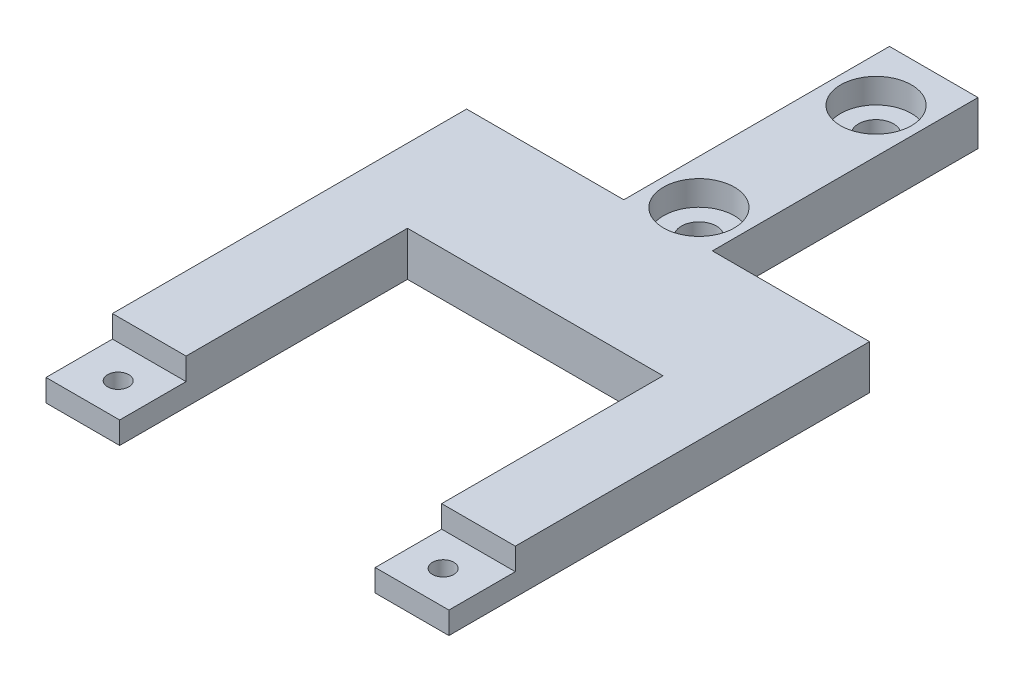
ISO-10303-21;
HEADER;
FILE_DESCRIPTION(('STEP AP214'),'2;1');
FILE_NAME('part.step','',(''),(''),'','','');
FILE_SCHEMA(('AUTOMOTIVE_DESIGN { 1 0 10303 214 1 1 1 1 }'));
ENDSEC;
DATA;
#1=APPLICATION_CONTEXT('core data for automotive mechanical design processes');
#2=APPLICATION_PROTOCOL_DEFINITION('international standard','automotive_design',2000,#1);
#3=PRODUCT_CONTEXT('',#1,'mechanical');
#4=PRODUCT('Part','Part','',(#3));
#5=PRODUCT_RELATED_PRODUCT_CATEGORY('part','',(#4));
#6=PRODUCT_DEFINITION_FORMATION('','',#4);
#7=PRODUCT_DEFINITION_CONTEXT('part definition',#1,'design');
#8=PRODUCT_DEFINITION('design','',#6,#7);
#9=PRODUCT_DEFINITION_SHAPE('','',#8);
#10=(LENGTH_UNIT() NAMED_UNIT(*) SI_UNIT(.MILLI.,.METRE.));
#11=(NAMED_UNIT(*) PLANE_ANGLE_UNIT() SI_UNIT($,.RADIAN.));
#12=(NAMED_UNIT(*) SI_UNIT($,.STERADIAN.) SOLID_ANGLE_UNIT());
#13=UNCERTAINTY_MEASURE_WITH_UNIT(LENGTH_MEASURE(1.E-05),#10,'distance_accuracy_value','');
#14=(GEOMETRIC_REPRESENTATION_CONTEXT(3) GLOBAL_UNCERTAINTY_ASSIGNED_CONTEXT((#13)) GLOBAL_UNIT_ASSIGNED_CONTEXT((#10,
#11,#12)) REPRESENTATION_CONTEXT('',''));
#15=CARTESIAN_POINT('',(0.,0.,0.));
#16=DIRECTION('',(0.,0.,1.));
#17=DIRECTION('',(1.,0.,0.));
#18=AXIS2_PLACEMENT_3D('',#15,#16,#17);
#19=CARTESIAN_POINT('',(-1.04723595372771E-13,-5.14368142394339,-29.9940298141337));
#20=DIRECTION('',(0.,1.,0.));
#21=DIRECTION('',(0.,0.,1.));
#22=AXIS2_PLACEMENT_3D('',#19,#20,#21);
#23=CYLINDRICAL_SURFACE('',#22,1.2573);
#24=CARTESIAN_POINT('',(-1.04723595372771E-13,-1.5875,-29.9940298141337));
#25=DIRECTION('',(0.,1.,0.));
#26=DIRECTION('',(0.,0.,1.));
#27=AXIS2_PLACEMENT_3D('',#24,#25,#26);
#28=CIRCLE('',#27,1.2573);
#29=CARTESIAN_POINT('',(-1.04723595372771E-13,-1.5875,-28.7367298141337));
#30=VERTEX_POINT('',#29);
#31=EDGE_CURVE('E240',#30,#30,#28,.F.);
#32=ORIENTED_EDGE('',*,*,#31,.T.);
#33=EDGE_LOOP('',(#32));
#34=FACE_BOUND('',#33,.T.);
#35=CARTESIAN_POINT('',(-1.04723595372771E-13,-0.1905,-29.9940298141337));
#36=DIRECTION('',(0.,1.,0.));
#37=DIRECTION('',(0.,0.,1.));
#38=AXIS2_PLACEMENT_3D('',#35,#36,#37);
#39=CIRCLE('',#38,1.2573);
#40=CARTESIAN_POINT('',(-1.04723595372771E-13,-0.1905,-28.7367298141337));
#41=VERTEX_POINT('',#40);
#42=EDGE_CURVE('E53',#41,#41,#39,.F.);
#43=ORIENTED_EDGE('',*,*,#42,.F.);
#44=EDGE_LOOP('',(#43));
#45=FACE_BOUND('',#44,.T.);
#46=ADVANCED_FACE('F49',(#34,#45),#23,.F.);
#47=CARTESIAN_POINT('',(0.,-5.14368142394339,-17.2940298141337));
#48=DIRECTION('',(0.,1.,0.));
#49=DIRECTION('',(0.,0.,1.));
#50=AXIS2_PLACEMENT_3D('',#47,#48,#49);
#51=CYLINDRICAL_SURFACE('',#50,1.2573);
#52=CARTESIAN_POINT('',(0.,-1.5875,-17.2940298141337));
#53=DIRECTION('',(0.,1.,0.));
#54=DIRECTION('',(0.,0.,1.));
#55=AXIS2_PLACEMENT_3D('',#52,#53,#54);
#56=CIRCLE('',#55,1.2573);
#57=CARTESIAN_POINT('',(0.,-1.5875,-16.0367298141337));
#58=VERTEX_POINT('',#57);
#59=EDGE_CURVE('E260',#58,#58,#56,.F.);
#60=ORIENTED_EDGE('',*,*,#59,.T.);
#61=EDGE_LOOP('',(#60));
#62=FACE_BOUND('',#61,.T.);
#63=CARTESIAN_POINT('',(0.,-0.1905,-17.2940298141337));
#64=DIRECTION('',(0.,1.,0.));
#65=DIRECTION('',(0.,0.,1.));
#66=AXIS2_PLACEMENT_3D('',#63,#64,#65);
#67=CIRCLE('',#66,1.2573);
#68=CARTESIAN_POINT('',(0.,-0.1905,-16.0367298141337));
#69=VERTEX_POINT('',#68);
#70=EDGE_CURVE('E234',#69,#69,#67,.F.);
#71=ORIENTED_EDGE('',*,*,#70,.F.);
#72=EDGE_LOOP('',(#71));
#73=FACE_BOUND('',#72,.T.);
#74=ADVANCED_FACE('F388',(#62,#73),#51,.F.);
#75=CARTESIAN_POINT('',(0.,1.5875,-5.55625));
#76=DIRECTION('',(0.,0.,-1.));
#77=DIRECTION('',(-1.,0.,0.));
#78=AXIS2_PLACEMENT_3D('',#75,#76,#77);
#79=PLANE('',#78);
#80=DIRECTION('',(1.,0.,0.));
#81=VECTOR('',#80,1.);
#82=CARTESIAN_POINT('',(0.,-1.5875,-5.55625));
#83=LINE('',#82,#81);
#84=CARTESIAN_POINT('',(-9.16305000000001,-1.5875,-5.55625));
#85=VERTEX_POINT('',#84);
#86=CARTESIAN_POINT('',(9.16305000000001,-1.5875,-5.55625));
#87=VERTEX_POINT('',#86);
#88=EDGE_CURVE('E287',#85,#87,#83,.T.);
#89=ORIENTED_EDGE('',*,*,#88,.T.);
#90=DIRECTION('',(0.,-1.,0.));
#91=VECTOR('',#90,1.);
#92=CARTESIAN_POINT('',(9.16305000000001,1.5875,-5.55625));
#93=LINE('',#92,#91);
#94=CARTESIAN_POINT('',(9.16305000000001,1.5875,-5.55625));
#95=VERTEX_POINT('',#94);
#96=EDGE_CURVE('E302',#95,#87,#93,.T.);
#97=ORIENTED_EDGE('',*,*,#96,.F.);
#98=DIRECTION('',(1.,0.,0.));
#99=VECTOR('',#98,1.);
#100=CARTESIAN_POINT('',(0.,1.5875,-5.55625));
#101=LINE('',#100,#99);
#102=CARTESIAN_POINT('',(-9.16305000000001,1.5875,-5.55625));
#103=VERTEX_POINT('',#102);
#104=EDGE_CURVE('E299',#103,#95,#101,.T.);
#105=ORIENTED_EDGE('',*,*,#104,.F.);
#106=DIRECTION('',(0.,-1.,0.));
#107=VECTOR('',#106,1.);
#108=CARTESIAN_POINT('',(-9.16305000000001,1.5875,-5.55625));
#109=LINE('',#108,#107);
#110=EDGE_CURVE('E193',#103,#85,#109,.T.);
#111=ORIENTED_EDGE('',*,*,#110,.T.);
#112=EDGE_LOOP('',(#89,#97,#105,#111));
#113=FACE_BOUND('',#112,.T.);
#114=ADVANCED_FACE('F326',(#113),#79,.F.);
#115=CARTESIAN_POINT('',(-9.16305000000001,1.5875,0.));
#116=DIRECTION('',(-1.,0.,0.));
#117=DIRECTION('',(0.,0.,1.));
#118=AXIS2_PLACEMENT_3D('',#115,#116,#117);
#119=PLANE('',#118);
#120=DIRECTION('',(0.,0.,-1.));
#121=VECTOR('',#120,1.);
#122=CARTESIAN_POINT('',(-9.16305000000001,1.5875,0.));
#123=LINE('',#122,#121);
#124=CARTESIAN_POINT('',(-9.16305000000001,1.5875,10.31875));
#125=VERTEX_POINT('',#124);
#126=EDGE_CURVE('E297',#125,#103,#123,.T.);
#127=ORIENTED_EDGE('',*,*,#126,.F.);
#128=DIRECTION('',(0.,1.,0.));
#129=VECTOR('',#128,1.);
#130=CARTESIAN_POINT('',(-9.16305000000001,0.,10.31875));
#131=LINE('',#130,#129);
#132=CARTESIAN_POINT('',(-9.16305000000001,0.,10.31875));
#133=VERTEX_POINT('',#132);
#134=EDGE_CURVE('E66',#133,#125,#131,.T.);
#135=ORIENTED_EDGE('',*,*,#134,.F.);
#136=DIRECTION('',(0.,0.,-1.));
#137=VECTOR('',#136,1.);
#138=CARTESIAN_POINT('',(-9.16305000000001,0.,15.08125));
#139=LINE('',#138,#137);
#140=CARTESIAN_POINT('',(-9.16305000000001,0.,15.08125));
#141=VERTEX_POINT('',#140);
#142=EDGE_CURVE('E183',#141,#133,#139,.T.);
#143=ORIENTED_EDGE('',*,*,#142,.F.);
#144=DIRECTION('',(0.,-1.,0.));
#145=VECTOR('',#144,1.);
#146=CARTESIAN_POINT('',(-9.16305000000001,1.5875,15.08125));
#147=LINE('',#146,#145);
#148=CARTESIAN_POINT('',(-9.16305000000001,-1.5875,15.08125));
#149=VERTEX_POINT('',#148);
#150=EDGE_CURVE('E182',#141,#149,#147,.T.);
#151=ORIENTED_EDGE('',*,*,#150,.T.);
#152=DIRECTION('',(0.,0.,-1.));
#153=VECTOR('',#152,1.);
#154=CARTESIAN_POINT('',(-9.16305000000001,-1.5875,0.));
#155=LINE('',#154,#153);
#156=EDGE_CURVE('E317',#149,#85,#155,.T.);
#157=ORIENTED_EDGE('',*,*,#156,.T.);
#158=ORIENTED_EDGE('',*,*,#110,.F.);
#159=EDGE_LOOP('',(#127,#135,#143,#151,#157,#158));
#160=FACE_BOUND('',#159,.T.);
#161=ADVANCED_FACE('F342',(#160),#119,.F.);
#162=CARTESIAN_POINT('',(0.,1.5875,15.08125));
#163=DIRECTION('',(0.,0.,-1.));
#164=DIRECTION('',(-1.,0.,0.));
#165=AXIS2_PLACEMENT_3D('',#162,#163,#164);
#166=PLANE('',#165);
#167=ORIENTED_EDGE('',*,*,#150,.F.);
#168=DIRECTION('',(1.,0.,0.));
#169=VECTOR('',#168,1.);
#170=CARTESIAN_POINT('',(-14.44625,0.,15.08125));
#171=LINE('',#170,#169);
#172=CARTESIAN_POINT('',(-14.44625,0.,15.08125));
#173=VERTEX_POINT('',#172);
#174=EDGE_CURVE('E168',#173,#141,#171,.T.);
#175=ORIENTED_EDGE('',*,*,#174,.F.);
#176=DIRECTION('',(0.,-1.,0.));
#177=VECTOR('',#176,1.);
#178=CARTESIAN_POINT('',(-14.44625,1.5875,15.08125));
#179=LINE('',#178,#177);
#180=CARTESIAN_POINT('',(-14.44625,-1.5875,15.08125));
#181=VERTEX_POINT('',#180);
#182=EDGE_CURVE('E180',#173,#181,#179,.T.);
#183=ORIENTED_EDGE('',*,*,#182,.T.);
#184=DIRECTION('',(1.,0.,0.));
#185=VECTOR('',#184,1.);
#186=CARTESIAN_POINT('',(0.,-1.5875,15.08125));
#187=LINE('',#186,#185);
#188=EDGE_CURVE('E309',#181,#149,#187,.T.);
#189=ORIENTED_EDGE('',*,*,#188,.T.);
#190=EDGE_LOOP('',(#167,#175,#183,#189));
#191=FACE_BOUND('',#190,.T.);
#192=ADVANCED_FACE('F178',(#191),#166,.F.);
#193=DIRECTION('',(0.,-1.,0.));
#194=VECTOR('',#193,1.);
#195=CARTESIAN_POINT('',(14.44625,1.5875,15.08125));
#196=LINE('',#195,#194);
#197=CARTESIAN_POINT('',(14.44625,0.,15.08125));
#198=VERTEX_POINT('',#197);
#199=CARTESIAN_POINT('',(14.44625,-1.5875,15.08125));
#200=VERTEX_POINT('',#199);
#201=EDGE_CURVE('E199',#198,#200,#196,.T.);
#202=ORIENTED_EDGE('',*,*,#201,.F.);
#203=DIRECTION('',(1.,0.,0.));
#204=VECTOR('',#203,1.);
#205=CARTESIAN_POINT('',(9.16305000000001,0.,15.08125));
#206=LINE('',#205,#204);
#207=CARTESIAN_POINT('',(9.16305000000001,0.,15.08125));
#208=VERTEX_POINT('',#207);
#209=EDGE_CURVE('E273',#208,#198,#206,.T.);
#210=ORIENTED_EDGE('',*,*,#209,.F.);
#211=DIRECTION('',(0.,-1.,0.));
#212=VECTOR('',#211,1.);
#213=CARTESIAN_POINT('',(9.16305000000001,1.5875,15.08125));
#214=LINE('',#213,#212);
#215=CARTESIAN_POINT('',(9.16305000000001,-1.5875,15.08125));
#216=VERTEX_POINT('',#215);
#217=EDGE_CURVE('E201',#208,#216,#214,.T.);
#218=ORIENTED_EDGE('',*,*,#217,.T.);
#219=EDGE_CURVE('E305',#216,#200,#187,.T.);
#220=ORIENTED_EDGE('',*,*,#219,.T.);
#221=EDGE_LOOP('',(#202,#210,#218,#220));
#222=FACE_BOUND('',#221,.T.);
#223=ADVANCED_FACE('F374',(#222),#166,.F.);
#224=CARTESIAN_POINT('',(9.16305000000001,1.5875,0.));
#225=DIRECTION('',(-1.,0.,0.));
#226=DIRECTION('',(0.,0.,1.));
#227=AXIS2_PLACEMENT_3D('',#224,#225,#226);
#228=PLANE('',#227);
#229=DIRECTION('',(0.,1.,0.));
#230=VECTOR('',#229,1.);
#231=CARTESIAN_POINT('',(9.16305000000001,0.,10.31875));
#232=LINE('',#231,#230);
#233=CARTESIAN_POINT('',(9.16305000000001,0.,10.31875));
#234=VERTEX_POINT('',#233);
#235=CARTESIAN_POINT('',(9.16305000000001,1.5875,10.31875));
#236=VERTEX_POINT('',#235);
#237=EDGE_CURVE('E268',#234,#236,#232,.T.);
#238=ORIENTED_EDGE('',*,*,#237,.T.);
#239=DIRECTION('',(0.,0.,-1.));
#240=VECTOR('',#239,1.);
#241=CARTESIAN_POINT('',(9.16305000000001,1.5875,0.));
#242=LINE('',#241,#240);
#243=EDGE_CURVE('E284',#236,#95,#242,.T.);
#244=ORIENTED_EDGE('',*,*,#243,.T.);
#245=ORIENTED_EDGE('',*,*,#96,.T.);
#246=DIRECTION('',(0.,0.,-1.));
#247=VECTOR('',#246,1.);
#248=CARTESIAN_POINT('',(9.16305000000001,-1.5875,0.));
#249=LINE('',#248,#247);
#250=EDGE_CURVE('E224',#216,#87,#249,.T.);
#251=ORIENTED_EDGE('',*,*,#250,.F.);
#252=ORIENTED_EDGE('',*,*,#217,.F.);
#253=DIRECTION('',(0.,0.,1.));
#254=VECTOR('',#253,1.);
#255=CARTESIAN_POINT('',(9.16305000000001,0.,15.08125));
#256=LINE('',#255,#254);
#257=EDGE_CURVE('E271',#234,#208,#256,.T.);
#258=ORIENTED_EDGE('',*,*,#257,.F.);
#259=EDGE_LOOP('',(#238,#244,#245,#251,#252,#258));
#260=FACE_BOUND('',#259,.T.);
#261=ADVANCED_FACE('F337',(#260),#228,.T.);
#262=CARTESIAN_POINT('',(14.44625,1.5875,0.));
#263=DIRECTION('',(1.,0.,0.));
#264=DIRECTION('',(0.,0.,-1.));
#265=AXIS2_PLACEMENT_3D('',#262,#263,#264);
#266=PLANE('',#265);
#267=DIRECTION('',(0.,1.,0.));
#268=VECTOR('',#267,1.);
#269=CARTESIAN_POINT('',(14.44625,0.,10.31875));
#270=LINE('',#269,#268);
#271=CARTESIAN_POINT('',(14.44625,0.,10.31875));
#272=VERTEX_POINT('',#271);
#273=CARTESIAN_POINT('',(14.44625,1.5875,10.31875));
#274=VERTEX_POINT('',#273);
#275=EDGE_CURVE('E74',#272,#274,#270,.T.);
#276=ORIENTED_EDGE('',*,*,#275,.F.);
#277=DIRECTION('',(0.,0.,-1.));
#278=VECTOR('',#277,1.);
#279=CARTESIAN_POINT('',(14.44625,0.,15.08125));
#280=LINE('',#279,#278);
#281=EDGE_CURVE('E275',#198,#272,#280,.T.);
#282=ORIENTED_EDGE('',*,*,#281,.F.);
#283=ORIENTED_EDGE('',*,*,#201,.T.);
#284=DIRECTION('',(0.,0.,1.));
#285=VECTOR('',#284,1.);
#286=CARTESIAN_POINT('',(14.44625,-1.5875,0.));
#287=LINE('',#286,#285);
#288=CARTESIAN_POINT('',(14.44625,-1.5875,-15.08125));
#289=VERTEX_POINT('',#288);
#290=EDGE_CURVE('E308',#289,#200,#287,.T.);
#291=ORIENTED_EDGE('',*,*,#290,.F.);
#292=DIRECTION('',(0.,-1.,0.));
#293=VECTOR('',#292,1.);
#294=CARTESIAN_POINT('',(14.44625,1.5875,-15.08125));
#295=LINE('',#294,#293);
#296=CARTESIAN_POINT('',(14.44625,1.5875,-15.08125));
#297=VERTEX_POINT('',#296);
#298=EDGE_CURVE('E191',#297,#289,#295,.T.);
#299=ORIENTED_EDGE('',*,*,#298,.F.);
#300=DIRECTION('',(0.,0.,1.));
#301=VECTOR('',#300,1.);
#302=CARTESIAN_POINT('',(14.44625,1.5875,0.));
#303=LINE('',#302,#301);
#304=EDGE_CURVE('E286',#297,#274,#303,.T.);
#305=ORIENTED_EDGE('',*,*,#304,.T.);
#306=EDGE_LOOP('',(#276,#282,#283,#291,#299,#305));
#307=FACE_BOUND('',#306,.T.);
#308=ADVANCED_FACE('F369',(#307),#266,.T.);
#309=CARTESIAN_POINT('',(-14.44625,1.5875,0.));
#310=DIRECTION('',(1.,0.,0.));
#311=DIRECTION('',(0.,0.,-1.));
#312=AXIS2_PLACEMENT_3D('',#309,#310,#311);
#313=PLANE('',#312);
#314=DIRECTION('',(0.,0.,1.));
#315=VECTOR('',#314,1.);
#316=CARTESIAN_POINT('',(-14.44625,0.,15.08125));
#317=LINE('',#316,#315);
#318=CARTESIAN_POINT('',(-14.44625,0.,10.31875));
#319=VERTEX_POINT('',#318);
#320=EDGE_CURVE('E165',#319,#173,#317,.T.);
#321=ORIENTED_EDGE('',*,*,#320,.F.);
#322=DIRECTION('',(0.,1.,0.));
#323=VECTOR('',#322,1.);
#324=CARTESIAN_POINT('',(-14.44625,0.,10.31875));
#325=LINE('',#324,#323);
#326=CARTESIAN_POINT('',(-14.44625,1.5875,10.31875));
#327=VERTEX_POINT('',#326);
#328=EDGE_CURVE('E217',#319,#327,#325,.T.);
#329=ORIENTED_EDGE('',*,*,#328,.T.);
#330=DIRECTION('',(0.,0.,1.));
#331=VECTOR('',#330,1.);
#332=CARTESIAN_POINT('',(-14.44625,1.5875,0.));
#333=LINE('',#332,#331);
#334=CARTESIAN_POINT('',(-14.44625,1.5875,-15.08125));
#335=VERTEX_POINT('',#334);
#336=EDGE_CURVE('E294',#335,#327,#333,.T.);
#337=ORIENTED_EDGE('',*,*,#336,.F.);
#338=DIRECTION('',(0.,-1.,0.));
#339=VECTOR('',#338,1.);
#340=CARTESIAN_POINT('',(-14.44625,1.5875,-15.08125));
#341=LINE('',#340,#339);
#342=CARTESIAN_POINT('',(-14.44625,-1.5875,-15.08125));
#343=VERTEX_POINT('',#342);
#344=EDGE_CURVE('E189',#335,#343,#341,.T.);
#345=ORIENTED_EDGE('',*,*,#344,.T.);
#346=DIRECTION('',(0.,0.,1.));
#347=VECTOR('',#346,1.);
#348=CARTESIAN_POINT('',(-14.44625,-1.5875,0.));
#349=LINE('',#348,#347);
#350=EDGE_CURVE('E187',#343,#181,#349,.T.);
#351=ORIENTED_EDGE('',*,*,#350,.T.);
#352=ORIENTED_EDGE('',*,*,#182,.F.);
#353=EDGE_LOOP('',(#321,#329,#337,#345,#351,#352));
#354=FACE_BOUND('',#353,.T.);
#355=ADVANCED_FACE('F185',(#354),#313,.F.);
#356=CARTESIAN_POINT('',(0.,-1.5875,0.));
#357=DIRECTION('',(0.,1.,0.));
#358=DIRECTION('',(0.,0.,1.));
#359=AXIS2_PLACEMENT_3D('',#356,#357,#358);
#360=PLANE('',#359);
#361=CARTESIAN_POINT('',(-11.65225,-1.5875,12.7));
#362=DIRECTION('',(0.,1.,0.));
#363=DIRECTION('',(0.,0.,1.));
#364=AXIS2_PLACEMENT_3D('',#361,#362,#363);
#365=CIRCLE('',#364,0.762000000000001);
#366=CARTESIAN_POINT('',(-11.65225,-1.5875,13.462));
#367=VERTEX_POINT('',#366);
#368=EDGE_CURVE('E231',#367,#367,#365,.F.);
#369=ORIENTED_EDGE('',*,*,#368,.F.);
#370=EDGE_LOOP('',(#369));
#371=FACE_BOUND('',#370,.T.);
#372=CARTESIAN_POINT('',(11.65225,-1.5875,12.7));
#373=DIRECTION('',(0.,1.,0.));
#374=DIRECTION('',(0.,0.,1.));
#375=AXIS2_PLACEMENT_3D('',#372,#373,#374);
#376=CIRCLE('',#375,0.762000000000001);
#377=CARTESIAN_POINT('',(11.65225,-1.5875,13.462));
#378=VERTEX_POINT('',#377);
#379=EDGE_CURVE('E257',#378,#378,#376,.F.);
#380=ORIENTED_EDGE('',*,*,#379,.F.);
#381=EDGE_LOOP('',(#380));
#382=FACE_BOUND('',#381,.T.);
#383=ORIENTED_EDGE('',*,*,#59,.F.);
#384=EDGE_LOOP('',(#383));
#385=FACE_BOUND('',#384,.T.);
#386=ORIENTED_EDGE('',*,*,#31,.F.);
#387=EDGE_LOOP('',(#386));
#388=FACE_BOUND('',#387,.T.);
#389=ORIENTED_EDGE('',*,*,#250,.T.);
#390=ORIENTED_EDGE('',*,*,#88,.F.);
#391=ORIENTED_EDGE('',*,*,#156,.F.);
#392=ORIENTED_EDGE('',*,*,#188,.F.);
#393=ORIENTED_EDGE('',*,*,#350,.F.);
#394=DIRECTION('',(1.,0.,0.));
#395=VECTOR('',#394,1.);
#396=CARTESIAN_POINT('',(0.,-1.5875,-15.08125));
#397=LINE('',#396,#395);
#398=CARTESIAN_POINT('',(-3.175,-1.5875,-15.08125));
#399=VERTEX_POINT('',#398);
#400=EDGE_CURVE('E313',#343,#399,#397,.T.);
#401=ORIENTED_EDGE('',*,*,#400,.T.);
#402=DIRECTION('',(0.,0.,-1.));
#403=VECTOR('',#402,1.);
#404=CARTESIAN_POINT('',(-3.175,-1.5875,-15.08125));
#405=LINE('',#404,#403);
#406=CARTESIAN_POINT('',(-3.175,-1.5875,-34.13125));
#407=VERTEX_POINT('',#406);
#408=EDGE_CURVE('E207',#399,#407,#405,.T.);
#409=ORIENTED_EDGE('',*,*,#408,.T.);
#410=DIRECTION('',(1.,0.,0.));
#411=VECTOR('',#410,1.);
#412=CARTESIAN_POINT('',(-3.175,-1.5875,-34.13125));
#413=LINE('',#412,#411);
#414=CARTESIAN_POINT('',(3.175,-1.5875,-34.13125));
#415=VERTEX_POINT('',#414);
#416=EDGE_CURVE('E213',#407,#415,#413,.T.);
#417=ORIENTED_EDGE('',*,*,#416,.T.);
#418=DIRECTION('',(0.,0.,-1.));
#419=VECTOR('',#418,1.);
#420=CARTESIAN_POINT('',(3.175,-1.5875,-15.08125));
#421=LINE('',#420,#419);
#422=CARTESIAN_POINT('',(3.175,-1.5875,-15.08125));
#423=VERTEX_POINT('',#422);
#424=EDGE_CURVE('E216',#423,#415,#421,.T.);
#425=ORIENTED_EDGE('',*,*,#424,.F.);
#426=EDGE_CURVE('E312',#423,#289,#397,.T.);
#427=ORIENTED_EDGE('',*,*,#426,.T.);
#428=ORIENTED_EDGE('',*,*,#290,.T.);
#429=ORIENTED_EDGE('',*,*,#219,.F.);
#430=EDGE_LOOP('',(#389,#390,#391,#392,#393,#401,#409,#417,#425,#427,#428,#429));
#431=FACE_BOUND('',#430,.T.);
#432=ADVANCED_FACE('F332',(#371,#382,#385,#388,#431),#360,.F.);
#433=CARTESIAN_POINT('',(0.,1.5875,0.));
#434=DIRECTION('',(0.,1.,0.));
#435=DIRECTION('',(0.,0.,1.));
#436=AXIS2_PLACEMENT_3D('',#433,#434,#435);
#437=PLANE('',#436);
#438=CARTESIAN_POINT('',(0.,1.5875,-17.2940298141337));
#439=DIRECTION('',(0.,1.,0.));
#440=DIRECTION('',(0.,0.,1.));
#441=AXIS2_PLACEMENT_3D('',#438,#439,#440);
#442=CIRCLE('',#441,2.54);
#443=CARTESIAN_POINT('',(0.,1.5875,-14.7540298141337));
#444=VERTEX_POINT('',#443);
#445=EDGE_CURVE('E242',#444,#444,#442,.T.);
#446=ORIENTED_EDGE('',*,*,#445,.F.);
#447=EDGE_LOOP('',(#446));
#448=FACE_BOUND('',#447,.T.);
#449=CARTESIAN_POINT('',(-1.04723595372771E-13,1.5875,-29.9940298141337));
#450=DIRECTION('',(0.,1.,0.));
#451=DIRECTION('',(0.,0.,1.));
#452=AXIS2_PLACEMENT_3D('',#449,#450,#451);
#453=CIRCLE('',#452,2.54);
#454=CARTESIAN_POINT('',(-1.04723595372771E-13,1.5875,-27.4540298141337));
#455=VERTEX_POINT('',#454);
#456=EDGE_CURVE('E252',#455,#455,#453,.T.);
#457=ORIENTED_EDGE('',*,*,#456,.F.);
#458=EDGE_LOOP('',(#457));
#459=FACE_BOUND('',#458,.T.);
#460=DIRECTION('',(-1.,0.,0.));
#461=VECTOR('',#460,1.);
#462=CARTESIAN_POINT('',(-14.44625,1.5875,10.31875));
#463=LINE('',#462,#461);
#464=EDGE_CURVE('E174',#125,#327,#463,.T.);
#465=ORIENTED_EDGE('',*,*,#464,.F.);
#466=ORIENTED_EDGE('',*,*,#126,.T.);
#467=ORIENTED_EDGE('',*,*,#104,.T.);
#468=ORIENTED_EDGE('',*,*,#243,.F.);
#469=DIRECTION('',(-1.,0.,0.));
#470=VECTOR('',#469,1.);
#471=CARTESIAN_POINT('',(9.16305000000001,1.5875,10.31875));
#472=LINE('',#471,#470);
#473=EDGE_CURVE('E233',#274,#236,#472,.T.);
#474=ORIENTED_EDGE('',*,*,#473,.F.);
#475=ORIENTED_EDGE('',*,*,#304,.F.);
#476=DIRECTION('',(1.,0.,0.));
#477=VECTOR('',#476,1.);
#478=CARTESIAN_POINT('',(0.,1.5875,-15.08125));
#479=LINE('',#478,#477);
#480=CARTESIAN_POINT('',(3.175,1.5875,-15.08125));
#481=VERTEX_POINT('',#480);
#482=EDGE_CURVE('E290',#481,#297,#479,.T.);
#483=ORIENTED_EDGE('',*,*,#482,.F.);
#484=DIRECTION('',(0.,0.,-1.));
#485=VECTOR('',#484,1.);
#486=CARTESIAN_POINT('',(3.175,1.5875,-15.08125));
#487=LINE('',#486,#485);
#488=CARTESIAN_POINT('',(3.175,1.5875,-34.13125));
#489=VERTEX_POINT('',#488);
#490=EDGE_CURVE('E206',#481,#489,#487,.T.);
#491=ORIENTED_EDGE('',*,*,#490,.T.);
#492=DIRECTION('',(1.,0.,0.));
#493=VECTOR('',#492,1.);
#494=CARTESIAN_POINT('',(-3.175,1.5875,-34.13125));
#495=LINE('',#494,#493);
#496=CARTESIAN_POINT('',(-3.175,1.5875,-34.13125));
#497=VERTEX_POINT('',#496);
#498=EDGE_CURVE('E203',#497,#489,#495,.T.);
#499=ORIENTED_EDGE('',*,*,#498,.F.);
#500=DIRECTION('',(0.,0.,-1.));
#501=VECTOR('',#500,1.);
#502=CARTESIAN_POINT('',(-3.175,1.5875,-15.08125));
#503=LINE('',#502,#501);
#504=CARTESIAN_POINT('',(-3.175,1.5875,-15.08125));
#505=VERTEX_POINT('',#504);
#506=EDGE_CURVE('E209',#505,#497,#503,.T.);
#507=ORIENTED_EDGE('',*,*,#506,.F.);
#508=EDGE_CURVE('E291',#335,#505,#479,.T.);
#509=ORIENTED_EDGE('',*,*,#508,.F.);
#510=ORIENTED_EDGE('',*,*,#336,.T.);
#511=EDGE_LOOP('',(#465,#466,#467,#468,#474,#475,#483,#491,#499,#507,#509,#510));
#512=FACE_BOUND('',#511,.T.);
#513=ADVANCED_FACE('F341',(#448,#459,#512),#437,.T.);
#514=CARTESIAN_POINT('',(0.,1.5875,-15.08125));
#515=DIRECTION('',(0.,0.,-1.));
#516=DIRECTION('',(-1.,0.,0.));
#517=AXIS2_PLACEMENT_3D('',#514,#515,#516);
#518=PLANE('',#517);
#519=ORIENTED_EDGE('',*,*,#508,.T.);
#520=DIRECTION('',(0.,-1.,0.));
#521=VECTOR('',#520,1.);
#522=CARTESIAN_POINT('',(-3.175,1.5875,-15.08125));
#523=LINE('',#522,#521);
#524=EDGE_CURVE('E58',#505,#399,#523,.T.);
#525=ORIENTED_EDGE('',*,*,#524,.T.);
#526=ORIENTED_EDGE('',*,*,#400,.F.);
#527=ORIENTED_EDGE('',*,*,#344,.F.);
#528=EDGE_LOOP('',(#519,#525,#526,#527));
#529=FACE_BOUND('',#528,.T.);
#530=ADVANCED_FACE('F349',(#529),#518,.T.);
#531=DIRECTION('',(0.,-1.,0.));
#532=VECTOR('',#531,1.);
#533=CARTESIAN_POINT('',(3.175,1.5875,-15.08125));
#534=LINE('',#533,#532);
#535=EDGE_CURVE('E13',#481,#423,#534,.T.);
#536=ORIENTED_EDGE('',*,*,#535,.F.);
#537=ORIENTED_EDGE('',*,*,#482,.T.);
#538=ORIENTED_EDGE('',*,*,#298,.T.);
#539=ORIENTED_EDGE('',*,*,#426,.F.);
#540=EDGE_LOOP('',(#536,#537,#538,#539));
#541=FACE_BOUND('',#540,.T.);
#542=ADVANCED_FACE('F363',(#541),#518,.T.);
#543=CARTESIAN_POINT('',(-3.175,1.5875,-34.13125));
#544=DIRECTION('',(0.,0.,-1.));
#545=DIRECTION('',(-1.,0.,0.));
#546=AXIS2_PLACEMENT_3D('',#543,#544,#545);
#547=PLANE('',#546);
#548=ORIENTED_EDGE('',*,*,#416,.F.);
#549=DIRECTION('',(0.,-1.,0.));
#550=VECTOR('',#549,1.);
#551=CARTESIAN_POINT('',(-3.175,1.5875,-34.13125));
#552=LINE('',#551,#550);
#553=EDGE_CURVE('E222',#497,#407,#552,.T.);
#554=ORIENTED_EDGE('',*,*,#553,.F.);
#555=ORIENTED_EDGE('',*,*,#498,.T.);
#556=DIRECTION('',(0.,-1.,0.));
#557=VECTOR('',#556,1.);
#558=CARTESIAN_POINT('',(3.175,1.5875,-34.13125));
#559=LINE('',#558,#557);
#560=EDGE_CURVE('E212',#489,#415,#559,.T.);
#561=ORIENTED_EDGE('',*,*,#560,.T.);
#562=EDGE_LOOP('',(#548,#554,#555,#561));
#563=FACE_BOUND('',#562,.T.);
#564=ADVANCED_FACE('F51',(#563),#547,.T.);
#565=CARTESIAN_POINT('',(-3.175,1.5875,-15.08125));
#566=DIRECTION('',(-1.,0.,0.));
#567=DIRECTION('',(0.,0.,1.));
#568=AXIS2_PLACEMENT_3D('',#565,#566,#567);
#569=PLANE('',#568);
#570=ORIENTED_EDGE('',*,*,#408,.F.);
#571=ORIENTED_EDGE('',*,*,#524,.F.);
#572=ORIENTED_EDGE('',*,*,#506,.T.);
#573=ORIENTED_EDGE('',*,*,#553,.T.);
#574=EDGE_LOOP('',(#570,#571,#572,#573));
#575=FACE_BOUND('',#574,.T.);
#576=ADVANCED_FACE('F355',(#575),#569,.T.);
#577=CARTESIAN_POINT('',(3.175,1.5875,-15.08125));
#578=DIRECTION('',(-1.,0.,0.));
#579=DIRECTION('',(0.,0.,1.));
#580=AXIS2_PLACEMENT_3D('',#577,#578,#579);
#581=PLANE('',#580);
#582=ORIENTED_EDGE('',*,*,#424,.T.);
#583=ORIENTED_EDGE('',*,*,#560,.F.);
#584=ORIENTED_EDGE('',*,*,#490,.F.);
#585=ORIENTED_EDGE('',*,*,#535,.T.);
#586=EDGE_LOOP('',(#582,#583,#584,#585));
#587=FACE_BOUND('',#586,.T.);
#588=ADVANCED_FACE('F360',(#587),#581,.F.);
#589=CARTESIAN_POINT('',(9.16305000000001,0.,10.31875));
#590=DIRECTION('',(0.,0.,-1.));
#591=DIRECTION('',(-1.,0.,0.));
#592=AXIS2_PLACEMENT_3D('',#589,#590,#591);
#593=PLANE('',#592);
#594=ORIENTED_EDGE('',*,*,#473,.T.);
#595=ORIENTED_EDGE('',*,*,#237,.F.);
#596=DIRECTION('',(-1.,0.,0.));
#597=VECTOR('',#596,1.);
#598=CARTESIAN_POINT('',(9.16305000000001,0.,10.31875));
#599=LINE('',#598,#597);
#600=EDGE_CURVE('E277',#272,#234,#599,.T.);
#601=ORIENTED_EDGE('',*,*,#600,.F.);
#602=ORIENTED_EDGE('',*,*,#275,.T.);
#603=EDGE_LOOP('',(#594,#595,#601,#602));
#604=FACE_BOUND('',#603,.T.);
#605=ADVANCED_FACE('F377',(#604),#593,.F.);
#606=CARTESIAN_POINT('',(0.,0.,0.));
#607=DIRECTION('',(0.,-1.,0.));
#608=DIRECTION('',(0.,0.,-1.));
#609=AXIS2_PLACEMENT_3D('',#606,#607,#608);
#610=PLANE('',#609);
#611=CARTESIAN_POINT('',(11.65225,0.,12.7));
#612=DIRECTION('',(0.,-1.,0.));
#613=DIRECTION('',(0.,0.,-1.));
#614=AXIS2_PLACEMENT_3D('',#611,#612,#613);
#615=CIRCLE('',#614,0.762000000000001);
#616=CARTESIAN_POINT('',(11.65225,0.,11.938));
#617=VERTEX_POINT('',#616);
#618=EDGE_CURVE('E230',#617,#617,#615,.T.);
#619=ORIENTED_EDGE('',*,*,#618,.T.);
#620=EDGE_LOOP('',(#619));
#621=FACE_BOUND('',#620,.T.);
#622=ORIENTED_EDGE('',*,*,#257,.T.);
#623=ORIENTED_EDGE('',*,*,#209,.T.);
#624=ORIENTED_EDGE('',*,*,#281,.T.);
#625=ORIENTED_EDGE('',*,*,#600,.T.);
#626=EDGE_LOOP('',(#622,#623,#624,#625));
#627=FACE_BOUND('',#626,.T.);
#628=ADVANCED_FACE('F376',(#621,#627),#610,.F.);
#629=CARTESIAN_POINT('',(-14.44625,0.,10.31875));
#630=DIRECTION('',(0.,0.,-1.));
#631=DIRECTION('',(-1.,0.,0.));
#632=AXIS2_PLACEMENT_3D('',#629,#630,#631);
#633=PLANE('',#632);
#634=ORIENTED_EDGE('',*,*,#464,.T.);
#635=ORIENTED_EDGE('',*,*,#328,.F.);
#636=DIRECTION('',(-1.,0.,0.));
#637=VECTOR('',#636,1.);
#638=CARTESIAN_POINT('',(-14.44625,0.,10.31875));
#639=LINE('',#638,#637);
#640=EDGE_CURVE('E170',#133,#319,#639,.T.);
#641=ORIENTED_EDGE('',*,*,#640,.F.);
#642=ORIENTED_EDGE('',*,*,#134,.T.);
#643=EDGE_LOOP('',(#634,#635,#641,#642));
#644=FACE_BOUND('',#643,.T.);
#645=ADVANCED_FACE('F343',(#644),#633,.F.);
#646=CARTESIAN_POINT('',(0.,0.,0.));
#647=DIRECTION('',(0.,-1.,0.));
#648=DIRECTION('',(0.,0.,-1.));
#649=AXIS2_PLACEMENT_3D('',#646,#647,#648);
#650=PLANE('',#649);
#651=CARTESIAN_POINT('',(-11.65225,0.,12.7));
#652=DIRECTION('',(0.,-1.,0.));
#653=DIRECTION('',(0.,0.,-1.));
#654=AXIS2_PLACEMENT_3D('',#651,#652,#653);
#655=CIRCLE('',#654,0.762000000000001);
#656=CARTESIAN_POINT('',(-11.65225,0.,11.938));
#657=VERTEX_POINT('',#656);
#658=EDGE_CURVE('E227',#657,#657,#655,.T.);
#659=ORIENTED_EDGE('',*,*,#658,.T.);
#660=EDGE_LOOP('',(#659));
#661=FACE_BOUND('',#660,.T.);
#662=ORIENTED_EDGE('',*,*,#320,.T.);
#663=ORIENTED_EDGE('',*,*,#174,.T.);
#664=ORIENTED_EDGE('',*,*,#142,.T.);
#665=ORIENTED_EDGE('',*,*,#640,.T.);
#666=EDGE_LOOP('',(#662,#663,#664,#665));
#667=FACE_BOUND('',#666,.T.);
#668=ADVANCED_FACE('F167',(#661,#667),#650,.F.);
#669=CARTESIAN_POINT('',(-11.65225,-5.14368142394339,12.7));
#670=DIRECTION('',(0.,1.,0.));
#671=DIRECTION('',(0.,0.,1.));
#672=AXIS2_PLACEMENT_3D('',#669,#670,#671);
#673=CYLINDRICAL_SURFACE('',#672,0.762000000000001);
#674=ORIENTED_EDGE('',*,*,#368,.T.);
#675=EDGE_LOOP('',(#674));
#676=FACE_BOUND('',#675,.T.);
#677=ORIENTED_EDGE('',*,*,#658,.F.);
#678=EDGE_LOOP('',(#677));
#679=FACE_BOUND('',#678,.T.);
#680=ADVANCED_FACE('F401',(#676,#679),#673,.F.);
#681=CARTESIAN_POINT('',(11.65225,-5.14368142394339,12.7));
#682=DIRECTION('',(0.,1.,0.));
#683=DIRECTION('',(0.,0.,1.));
#684=AXIS2_PLACEMENT_3D('',#681,#682,#683);
#685=CYLINDRICAL_SURFACE('',#684,0.762000000000001);
#686=ORIENTED_EDGE('',*,*,#379,.T.);
#687=EDGE_LOOP('',(#686));
#688=FACE_BOUND('',#687,.T.);
#689=ORIENTED_EDGE('',*,*,#618,.F.);
#690=EDGE_LOOP('',(#689));
#691=FACE_BOUND('',#690,.T.);
#692=ADVANCED_FACE('F419',(#688,#691),#685,.F.);
#693=CARTESIAN_POINT('',(0.,-0.1905,-17.2940298141337));
#694=DIRECTION('',(0.,1.,0.));
#695=DIRECTION('',(0.,0.,1.));
#696=AXIS2_PLACEMENT_3D('',#693,#694,#695);
#697=PLANE('',#696);
#698=CARTESIAN_POINT('',(0.,-0.1905,-17.2940298141337));
#699=DIRECTION('',(0.,1.,0.));
#700=DIRECTION('',(0.,0.,1.));
#701=AXIS2_PLACEMENT_3D('',#698,#699,#700);
#702=CIRCLE('',#701,2.54);
#703=CARTESIAN_POINT('',(0.,-0.1905,-14.7540298141337));
#704=VERTEX_POINT('',#703);
#705=EDGE_CURVE('E236',#704,#704,#702,.T.);
#706=ORIENTED_EDGE('',*,*,#705,.T.);
#707=EDGE_LOOP('',(#706));
#708=FACE_BOUND('',#707,.T.);
#709=ORIENTED_EDGE('',*,*,#70,.T.);
#710=EDGE_LOOP('',(#709));
#711=FACE_BOUND('',#710,.T.);
#712=ADVANCED_FACE('F427',(#708,#711),#697,.T.);
#713=CARTESIAN_POINT('',(0.,-0.1905,-17.2940298141337));
#714=DIRECTION('',(0.,1.,0.));
#715=DIRECTION('',(0.,0.,1.));
#716=AXIS2_PLACEMENT_3D('',#713,#714,#715);
#717=CYLINDRICAL_SURFACE('',#716,2.54);
#718=ORIENTED_EDGE('',*,*,#705,.F.);
#719=EDGE_LOOP('',(#718));
#720=FACE_BOUND('',#719,.T.);
#721=ORIENTED_EDGE('',*,*,#445,.T.);
#722=EDGE_LOOP('',(#721));
#723=FACE_BOUND('',#722,.T.);
#724=ADVANCED_FACE('F434',(#720,#723),#717,.F.);
#725=CARTESIAN_POINT('',(-1.04723595372771E-13,-0.1905,-29.9940298141337));
#726=DIRECTION('',(0.,1.,0.));
#727=DIRECTION('',(0.,0.,1.));
#728=AXIS2_PLACEMENT_3D('',#725,#726,#727);
#729=PLANE('',#728);
#730=CARTESIAN_POINT('',(-1.04723595372771E-13,-0.1905,-29.9940298141337));
#731=DIRECTION('',(0.,1.,0.));
#732=DIRECTION('',(0.,0.,1.));
#733=AXIS2_PLACEMENT_3D('',#730,#731,#732);
#734=CIRCLE('',#733,2.54);
#735=CARTESIAN_POINT('',(-1.04723595372771E-13,-0.1905,-27.4540298141337));
#736=VERTEX_POINT('',#735);
#737=EDGE_CURVE('E247',#736,#736,#734,.T.);
#738=ORIENTED_EDGE('',*,*,#737,.T.);
#739=EDGE_LOOP('',(#738));
#740=FACE_BOUND('',#739,.T.);
#741=ORIENTED_EDGE('',*,*,#42,.T.);
#742=EDGE_LOOP('',(#741));
#743=FACE_BOUND('',#742,.T.);
#744=ADVANCED_FACE('F442',(#740,#743),#729,.T.);
#745=CARTESIAN_POINT('',(-1.04723595372771E-13,-0.1905,-29.9940298141337));
#746=DIRECTION('',(0.,1.,0.));
#747=DIRECTION('',(0.,0.,1.));
#748=AXIS2_PLACEMENT_3D('',#745,#746,#747);
#749=CYLINDRICAL_SURFACE('',#748,2.54);
#750=ORIENTED_EDGE('',*,*,#737,.F.);
#751=EDGE_LOOP('',(#750));
#752=FACE_BOUND('',#751,.T.);
#753=ORIENTED_EDGE('',*,*,#456,.T.);
#754=EDGE_LOOP('',(#753));
#755=FACE_BOUND('',#754,.T.);
#756=ADVANCED_FACE('F450',(#752,#755),#749,.F.);
#757=CLOSED_SHELL('',(#46,#74,#114,#161,#192,#223,#261,#308,#355,#432,#513,#530,#542,#564,#576,
#588,#605,#628,#645,#668,#680,#692,#712,#724,#744,#756));
#758=MANIFOLD_SOLID_BREP('B2',#757);
#759=ADVANCED_BREP_SHAPE_REPRESENTATION('',(#18,#758),#14);
#760=SHAPE_DEFINITION_REPRESENTATION(#9,#759);
ENDSEC;
END-ISO-10303-21;
